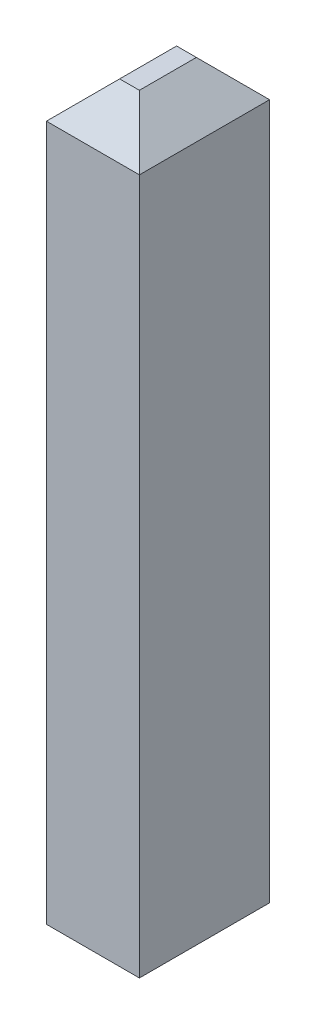
ISO-10303-21;
HEADER;
FILE_DESCRIPTION(('STEP AP214'),'2;1');
FILE_NAME('part.step','',(''),(''),'','','');
FILE_SCHEMA(('AUTOMOTIVE_DESIGN { 1 0 10303 214 1 1 1 1 }'));
ENDSEC;
DATA;
#1=APPLICATION_CONTEXT('core data for automotive mechanical design processes');
#2=APPLICATION_PROTOCOL_DEFINITION('international standard','automotive_design',2000,#1);
#3=PRODUCT_CONTEXT('',#1,'mechanical');
#4=PRODUCT('Part','Part','',(#3));
#5=PRODUCT_RELATED_PRODUCT_CATEGORY('part','',(#4));
#6=PRODUCT_DEFINITION_FORMATION('','',#4);
#7=PRODUCT_DEFINITION_CONTEXT('part definition',#1,'design');
#8=PRODUCT_DEFINITION('design','',#6,#7);
#9=PRODUCT_DEFINITION_SHAPE('','',#8);
#10=(LENGTH_UNIT() NAMED_UNIT(*) SI_UNIT(.MILLI.,.METRE.));
#11=(NAMED_UNIT(*) PLANE_ANGLE_UNIT() SI_UNIT($,.RADIAN.));
#12=(NAMED_UNIT(*) SI_UNIT($,.STERADIAN.) SOLID_ANGLE_UNIT());
#13=UNCERTAINTY_MEASURE_WITH_UNIT(LENGTH_MEASURE(1.E-05),#10,'distance_accuracy_value','');
#14=(GEOMETRIC_REPRESENTATION_CONTEXT(3) GLOBAL_UNCERTAINTY_ASSIGNED_CONTEXT((#13)) GLOBAL_UNIT_ASSIGNED_CONTEXT((#10,
#11,#12)) REPRESENTATION_CONTEXT('',''));
#15=CARTESIAN_POINT('',(0.,0.,0.));
#16=DIRECTION('',(0.,0.,1.));
#17=DIRECTION('',(1.,0.,0.));
#18=AXIS2_PLACEMENT_3D('',#15,#16,#17);
#19=CARTESIAN_POINT('',(0.127,2.,0.1778));
#20=DIRECTION('',(-1.,0.,0.));
#21=DIRECTION('',(0.,0.,1.));
#22=AXIS2_PLACEMENT_3D('',#19,#20,#21);
#23=PLANE('',#22);
#24=DIRECTION('',(0.,-1.,0.));
#25=VECTOR('',#24,1.);
#26=CARTESIAN_POINT('',(0.127,2.,-0.1778));
#27=LINE('',#26,#25);
#28=CARTESIAN_POINT('',(0.127,1.9,-0.1778));
#29=VERTEX_POINT('',#28);
#30=CARTESIAN_POINT('',(0.127,0.,-0.1778));
#31=VERTEX_POINT('',#30);
#32=EDGE_CURVE('E86',#29,#31,#27,.T.);
#33=ORIENTED_EDGE('',*,*,#32,.F.);
#34=DIRECTION('',(0.,0.,1.));
#35=VECTOR('',#34,1.);
#36=CARTESIAN_POINT('',(0.127,1.9,0.1778));
#37=LINE('',#36,#35);
#38=CARTESIAN_POINT('',(0.127,1.9,0.1778));
#39=VERTEX_POINT('',#38);
#40=EDGE_CURVE('E11',#29,#39,#37,.T.);
#41=ORIENTED_EDGE('',*,*,#40,.T.);
#42=DIRECTION('',(0.,-1.,0.));
#43=VECTOR('',#42,1.);
#44=CARTESIAN_POINT('',(0.127,2.,0.1778));
#45=LINE('',#44,#43);
#46=CARTESIAN_POINT('',(0.127,0.,0.1778));
#47=VERTEX_POINT('',#46);
#48=EDGE_CURVE('E109',#39,#47,#45,.T.);
#49=ORIENTED_EDGE('',*,*,#48,.T.);
#50=DIRECTION('',(0.,0.,-1.));
#51=VECTOR('',#50,1.);
#52=CARTESIAN_POINT('',(0.127,0.,0.1778));
#53=LINE('',#52,#51);
#54=EDGE_CURVE('E104',#47,#31,#53,.T.);
#55=ORIENTED_EDGE('',*,*,#54,.T.);
#56=EDGE_LOOP('',(#33,#41,#49,#55));
#57=FACE_BOUND('',#56,.T.);
#58=ADVANCED_FACE('F30',(#57),#23,.F.);
#59=CARTESIAN_POINT('',(-0.127,2.,-0.1778));
#60=DIRECTION('',(0.,0.,1.));
#61=DIRECTION('',(1.,0.,0.));
#62=AXIS2_PLACEMENT_3D('',#59,#60,#61);
#63=PLANE('',#62);
#64=DIRECTION('',(0.,-1.,0.));
#65=VECTOR('',#64,1.);
#66=CARTESIAN_POINT('',(-0.127,2.,-0.1778));
#67=LINE('',#66,#65);
#68=CARTESIAN_POINT('',(-0.127,1.9,-0.1778));
#69=VERTEX_POINT('',#68);
#70=CARTESIAN_POINT('',(-0.127,0.,-0.1778));
#71=VERTEX_POINT('',#70);
#72=EDGE_CURVE('E98',#69,#71,#67,.T.);
#73=ORIENTED_EDGE('',*,*,#72,.F.);
#74=DIRECTION('',(1.,0.,0.));
#75=VECTOR('',#74,1.);
#76=CARTESIAN_POINT('',(-0.127,1.9,-0.1778));
#77=LINE('',#76,#75);
#78=EDGE_CURVE('E93',#69,#29,#77,.T.);
#79=ORIENTED_EDGE('',*,*,#78,.T.);
#80=ORIENTED_EDGE('',*,*,#32,.T.);
#81=DIRECTION('',(-1.,0.,0.));
#82=VECTOR('',#81,1.);
#83=CARTESIAN_POINT('',(-0.127,0.,-0.1778));
#84=LINE('',#83,#82);
#85=EDGE_CURVE('E90',#31,#71,#84,.T.);
#86=ORIENTED_EDGE('',*,*,#85,.T.);
#87=EDGE_LOOP('',(#73,#79,#80,#86));
#88=FACE_BOUND('',#87,.T.);
#89=ADVANCED_FACE('F89',(#88),#63,.F.);
#90=CARTESIAN_POINT('',(-0.127,2.,0.1778));
#91=DIRECTION('',(1.,0.,0.));
#92=DIRECTION('',(0.,0.,-1.));
#93=AXIS2_PLACEMENT_3D('',#90,#91,#92);
#94=PLANE('',#93);
#95=DIRECTION('',(0.,-1.,0.));
#96=VECTOR('',#95,1.);
#97=CARTESIAN_POINT('',(-0.127,2.,0.1778));
#98=LINE('',#97,#96);
#99=CARTESIAN_POINT('',(-0.127,1.9,0.1778));
#100=VERTEX_POINT('',#99);
#101=CARTESIAN_POINT('',(-0.127,0.,0.1778));
#102=VERTEX_POINT('',#101);
#103=EDGE_CURVE('E117',#100,#102,#98,.T.);
#104=ORIENTED_EDGE('',*,*,#103,.F.);
#105=DIRECTION('',(0.,0.,-1.));
#106=VECTOR('',#105,1.);
#107=CARTESIAN_POINT('',(-0.127,1.9,0.1778));
#108=LINE('',#107,#106);
#109=EDGE_CURVE('E135',#100,#69,#108,.T.);
#110=ORIENTED_EDGE('',*,*,#109,.T.);
#111=ORIENTED_EDGE('',*,*,#72,.T.);
#112=DIRECTION('',(0.,0.,1.));
#113=VECTOR('',#112,1.);
#114=CARTESIAN_POINT('',(-0.127,0.,0.1778));
#115=LINE('',#114,#113);
#116=EDGE_CURVE('E106',#71,#102,#115,.T.);
#117=ORIENTED_EDGE('',*,*,#116,.T.);
#118=EDGE_LOOP('',(#104,#110,#111,#117));
#119=FACE_BOUND('',#118,.T.);
#120=ADVANCED_FACE('F159',(#119),#94,.F.);
#121=CARTESIAN_POINT('',(-0.127,2.,0.1778));
#122=DIRECTION('',(0.,0.,-1.));
#123=DIRECTION('',(-1.,0.,0.));
#124=AXIS2_PLACEMENT_3D('',#121,#122,#123);
#125=PLANE('',#124);
#126=ORIENTED_EDGE('',*,*,#48,.F.);
#127=DIRECTION('',(-1.,0.,0.));
#128=VECTOR('',#127,1.);
#129=CARTESIAN_POINT('',(-0.127,1.9,0.1778));
#130=LINE('',#129,#128);
#131=EDGE_CURVE('E125',#39,#100,#130,.T.);
#132=ORIENTED_EDGE('',*,*,#131,.T.);
#133=ORIENTED_EDGE('',*,*,#103,.T.);
#134=DIRECTION('',(1.,0.,0.));
#135=VECTOR('',#134,1.);
#136=CARTESIAN_POINT('',(-0.127,0.,0.1778));
#137=LINE('',#136,#135);
#138=EDGE_CURVE('E114',#102,#47,#137,.T.);
#139=ORIENTED_EDGE('',*,*,#138,.T.);
#140=EDGE_LOOP('',(#126,#132,#133,#139));
#141=FACE_BOUND('',#140,.T.);
#142=ADVANCED_FACE('F171',(#141),#125,.F.);
#143=CARTESIAN_POINT('',(0.127,2.,-0.1778));
#144=DIRECTION('',(0.,-1.,0.));
#145=DIRECTION('',(0.,0.,-1.));
#146=AXIS2_PLACEMENT_3D('',#143,#144,#145);
#147=PLANE('',#146);
#148=DIRECTION('',(-1.,0.,0.));
#149=VECTOR('',#148,1.);
#150=CARTESIAN_POINT('',(0.127,2.,-0.0777999999999997));
#151=LINE('',#150,#149);
#152=CARTESIAN_POINT('',(0.0270000000000003,2.,-0.0777999999999998));
#153=VERTEX_POINT('',#152);
#154=CARTESIAN_POINT('',(-0.0269999999999997,2.,-0.0777999999999998));
#155=VERTEX_POINT('',#154);
#156=EDGE_CURVE('E121',#153,#155,#151,.T.);
#157=ORIENTED_EDGE('',*,*,#156,.T.);
#158=DIRECTION('',(0.,0.,1.));
#159=VECTOR('',#158,1.);
#160=CARTESIAN_POINT('',(-0.0269999999999997,2.,-0.1778));
#161=LINE('',#160,#159);
#162=CARTESIAN_POINT('',(-0.0269999999999997,2.,0.0777999999999998));
#163=VERTEX_POINT('',#162);
#164=EDGE_CURVE('E131',#155,#163,#161,.T.);
#165=ORIENTED_EDGE('',*,*,#164,.T.);
#166=DIRECTION('',(1.,0.,0.));
#167=VECTOR('',#166,1.);
#168=CARTESIAN_POINT('',(0.127,2.,0.0777999999999997));
#169=LINE('',#168,#167);
#170=CARTESIAN_POINT('',(0.0270000000000003,2.,0.0777999999999998));
#171=VERTEX_POINT('',#170);
#172=EDGE_CURVE('E97',#163,#171,#169,.T.);
#173=ORIENTED_EDGE('',*,*,#172,.T.);
#174=DIRECTION('',(0.,0.,-1.));
#175=VECTOR('',#174,1.);
#176=CARTESIAN_POINT('',(0.0270000000000002,2.,-0.1778));
#177=LINE('',#176,#175);
#178=EDGE_CURVE('E128',#171,#153,#177,.T.);
#179=ORIENTED_EDGE('',*,*,#178,.T.);
#180=EDGE_LOOP('',(#157,#165,#173,#179));
#181=FACE_BOUND('',#180,.T.);
#182=ADVANCED_FACE('F143',(#181),#147,.F.);
#183=CARTESIAN_POINT('',(0.127,0.,-0.1778));
#184=DIRECTION('',(0.,-1.,0.));
#185=DIRECTION('',(0.,0.,-1.));
#186=AXIS2_PLACEMENT_3D('',#183,#184,#185);
#187=PLANE('',#186);
#188=ORIENTED_EDGE('',*,*,#54,.F.);
#189=ORIENTED_EDGE('',*,*,#138,.F.);
#190=ORIENTED_EDGE('',*,*,#116,.F.);
#191=ORIENTED_EDGE('',*,*,#85,.F.);
#192=EDGE_LOOP('',(#188,#189,#190,#191));
#193=FACE_BOUND('',#192,.T.);
#194=ADVANCED_FACE('F102',(#193),#187,.T.);
#195=CARTESIAN_POINT('',(0.127,2.,-0.0777999999999997));
#196=DIRECTION('',(0.,-0.707106781186546,0.707106781186549));
#197=DIRECTION('',(0.,-0.707106781186549,-0.707106781186546));
#198=AXIS2_PLACEMENT_3D('',#195,#196,#197);
#199=PLANE('',#198);
#200=ORIENTED_EDGE('',*,*,#78,.F.);
#201=DIRECTION('',(0.577350269189625,0.577350269189627,0.577350269189625));
#202=VECTOR('',#201,1.);
#203=CARTESIAN_POINT('',(0.0243333333333334,2.05133333333333,-0.0264666666666666));
#204=LINE('',#203,#202);
#205=EDGE_CURVE('E38',#69,#155,#204,.T.);
#206=ORIENTED_EDGE('',*,*,#205,.T.);
#207=ORIENTED_EDGE('',*,*,#156,.F.);
#208=DIRECTION('',(0.577350269189625,-0.577350269189627,-0.577350269189625));
#209=VECTOR('',#208,1.);
#210=CARTESIAN_POINT('',(0.0603333333333334,1.96666666666667,-0.111133333333333));
#211=LINE('',#210,#209);
#212=EDGE_CURVE('E137',#153,#29,#211,.T.);
#213=ORIENTED_EDGE('',*,*,#212,.T.);
#214=EDGE_LOOP('',(#200,#206,#207,#213));
#215=FACE_BOUND('',#214,.T.);
#216=ADVANCED_FACE('F141',(#215),#199,.F.);
#217=CARTESIAN_POINT('',(0.127,2.,0.0777999999999997));
#218=DIRECTION('',(0.,-0.707106781186546,-0.707106781186549));
#219=DIRECTION('',(0.,0.707106781186549,-0.707106781186546));
#220=AXIS2_PLACEMENT_3D('',#217,#218,#219);
#221=PLANE('',#220);
#222=ORIENTED_EDGE('',*,*,#172,.F.);
#223=DIRECTION('',(-0.577350269189625,-0.577350269189627,0.577350269189625));
#224=VECTOR('',#223,1.);
#225=CARTESIAN_POINT('',(0.0243333333333334,2.05133333333333,0.0264666666666666));
#226=LINE('',#225,#224);
#227=EDGE_CURVE('E53',#163,#100,#226,.T.);
#228=ORIENTED_EDGE('',*,*,#227,.T.);
#229=ORIENTED_EDGE('',*,*,#131,.F.);
#230=DIRECTION('',(-0.577350269189625,0.577350269189627,-0.577350269189625));
#231=VECTOR('',#230,1.);
#232=CARTESIAN_POINT('',(0.0603333333333334,1.96666666666667,0.111133333333333));
#233=LINE('',#232,#231);
#234=EDGE_CURVE('E45',#39,#171,#233,.T.);
#235=ORIENTED_EDGE('',*,*,#234,.T.);
#236=EDGE_LOOP('',(#222,#228,#229,#235));
#237=FACE_BOUND('',#236,.T.);
#238=ADVANCED_FACE('F147',(#237),#221,.F.);
#239=CARTESIAN_POINT('',(-0.0269999999999997,2.,-0.1778));
#240=DIRECTION('',(0.707106781186549,-0.707106781186546,0.));
#241=DIRECTION('',(0.707106781186546,0.707106781186549,0.));
#242=AXIS2_PLACEMENT_3D('',#239,#240,#241);
#243=PLANE('',#242);
#244=ORIENTED_EDGE('',*,*,#205,.F.);
#245=ORIENTED_EDGE('',*,*,#109,.F.);
#246=ORIENTED_EDGE('',*,*,#227,.F.);
#247=ORIENTED_EDGE('',*,*,#164,.F.);
#248=EDGE_LOOP('',(#244,#245,#246,#247));
#249=FACE_BOUND('',#248,.T.);
#250=ADVANCED_FACE('F145',(#249),#243,.F.);
#251=CARTESIAN_POINT('',(0.0270000000000002,2.,-0.1778));
#252=DIRECTION('',(-0.707106781186549,-0.707106781186546,0.));
#253=DIRECTION('',(0.707106781186546,-0.707106781186549,0.));
#254=AXIS2_PLACEMENT_3D('',#251,#252,#253);
#255=PLANE('',#254);
#256=ORIENTED_EDGE('',*,*,#234,.F.);
#257=ORIENTED_EDGE('',*,*,#40,.F.);
#258=ORIENTED_EDGE('',*,*,#212,.F.);
#259=ORIENTED_EDGE('',*,*,#178,.F.);
#260=EDGE_LOOP('',(#256,#257,#258,#259));
#261=FACE_BOUND('',#260,.T.);
#262=ADVANCED_FACE('F32',(#261),#255,.F.);
#263=CLOSED_SHELL('',(#58,#89,#120,#142,#182,#194,#216,#238,#250,#262));
#264=MANIFOLD_SOLID_BREP('B2',#263);
#265=ADVANCED_BREP_SHAPE_REPRESENTATION('',(#18,#264),#14);
#266=SHAPE_DEFINITION_REPRESENTATION(#9,#265);
ENDSEC;
END-ISO-10303-21;
